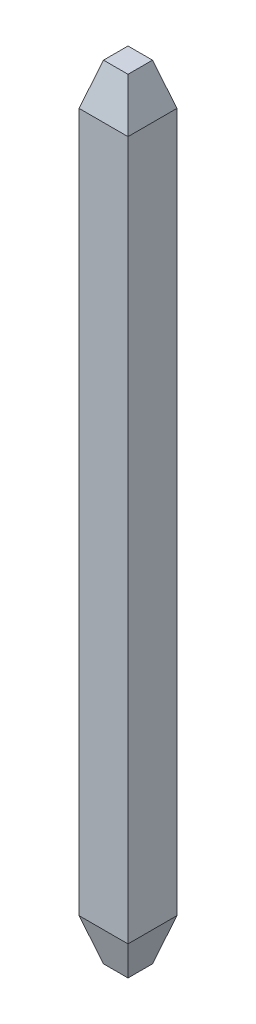
ISO-10303-21;
HEADER;
FILE_DESCRIPTION(('STEP AP214'),'2;1');
FILE_NAME('part.step','',(''),(''),'','','');
FILE_SCHEMA(('AUTOMOTIVE_DESIGN { 1 0 10303 214 1 1 1 1 }'));
ENDSEC;
DATA;
#1=APPLICATION_CONTEXT('core data for automotive mechanical design processes');
#2=APPLICATION_PROTOCOL_DEFINITION('international standard','automotive_design',2000,#1);
#3=PRODUCT_CONTEXT('',#1,'mechanical');
#4=PRODUCT('Part','Part','',(#3));
#5=PRODUCT_RELATED_PRODUCT_CATEGORY('part','',(#4));
#6=PRODUCT_DEFINITION_FORMATION('','',#4);
#7=PRODUCT_DEFINITION_CONTEXT('part definition',#1,'design');
#8=PRODUCT_DEFINITION('design','',#6,#7);
#9=PRODUCT_DEFINITION_SHAPE('','',#8);
#10=(LENGTH_UNIT() NAMED_UNIT(*) SI_UNIT(.MILLI.,.METRE.));
#11=(NAMED_UNIT(*) PLANE_ANGLE_UNIT() SI_UNIT($,.RADIAN.));
#12=(NAMED_UNIT(*) SI_UNIT($,.STERADIAN.) SOLID_ANGLE_UNIT());
#13=UNCERTAINTY_MEASURE_WITH_UNIT(LENGTH_MEASURE(1.E-05),#10,'distance_accuracy_value','');
#14=(GEOMETRIC_REPRESENTATION_CONTEXT(3) GLOBAL_UNCERTAINTY_ASSIGNED_CONTEXT((#13)) GLOBAL_UNIT_ASSIGNED_CONTEXT((#10,
#11,#12)) REPRESENTATION_CONTEXT('',''));
#15=CARTESIAN_POINT('',(0.,0.,0.));
#16=DIRECTION('',(0.,0.,1.));
#17=DIRECTION('',(1.,0.,0.));
#18=AXIS2_PLACEMENT_3D('',#15,#16,#17);
#19=CARTESIAN_POINT('',(4.29000000001296,-10.1039999999832,-19.5199999999763));
#20=DIRECTION('',(0.959644900900968,-0.281214622974643,0.));
#21=DIRECTION('',(0.,0.,-1.));
#22=AXIS2_PLACEMENT_3D('',#19,#20,#21);
#23=PLANE('',#22);
#24=DIRECTION('',(0.,0.,1.));
#25=VECTOR('',#24,1.);
#26=CARTESIAN_POINT('',(4.29000000001296,-10.1039999999832,-19.8399999999763));
#27=LINE('',#26,#25);
#28=CARTESIAN_POINT('',(4.29000000001293,-10.1039999999832,-19.8399999999763));
#29=VERTEX_POINT('',#28);
#30=CARTESIAN_POINT('',(4.29000000001293,-10.1039999999832,-19.1999999999763));
#31=VERTEX_POINT('',#30);
#32=EDGE_CURVE('E11',#29,#31,#27,.T.);
#33=ORIENTED_EDGE('',*,*,#32,.T.);
#34=DIRECTION('',(-0.270714017147727,-0.923811583516618,-0.270714017147727));
#35=VECTOR('',#34,1.);
#36=CARTESIAN_POINT('',(4.29000000001296,-10.1039999999832,-19.1999999999763));
#37=LINE('',#36,#35);
#38=CARTESIAN_POINT('',(4.13000000001293,-10.6499999999832,-19.3599999999763));
#39=VERTEX_POINT('',#38);
#40=EDGE_CURVE('E28',#31,#39,#37,.T.);
#41=ORIENTED_EDGE('',*,*,#40,.T.);
#42=DIRECTION('',(0.,0.,1.));
#43=VECTOR('',#42,1.);
#44=CARTESIAN_POINT('',(4.13000000001296,-10.6499999999832,-19.6799999999763));
#45=LINE('',#44,#43);
#46=CARTESIAN_POINT('',(4.13000000001293,-10.6499999999832,-19.6799999999763));
#47=VERTEX_POINT('',#46);
#48=EDGE_CURVE('E96',#47,#39,#45,.T.);
#49=ORIENTED_EDGE('',*,*,#48,.F.);
#50=DIRECTION('',(-0.270714017147727,-0.923811583516618,0.270714017147727));
#51=VECTOR('',#50,1.);
#52=CARTESIAN_POINT('',(4.29000000001296,-10.1039999999832,-19.8399999999763));
#53=LINE('',#52,#51);
#54=EDGE_CURVE('E21',#29,#47,#53,.T.);
#55=ORIENTED_EDGE('',*,*,#54,.F.);
#56=EDGE_LOOP('',(#33,#41,#49,#55));
#57=FACE_BOUND('',#56,.T.);
#58=ADVANCED_FACE('F17',(#57),#23,.T.);
#59=CARTESIAN_POINT('',(4.29000000001296,-11.0738701069127,-19.5199999999763));
#60=DIRECTION('',(1.,0.,0.));
#61=DIRECTION('',(0.,1.,0.));
#62=AXIS2_PLACEMENT_3D('',#59,#60,#61);
#63=PLANE('',#62);
#64=DIRECTION('',(0.,1.,0.));
#65=VECTOR('',#64,1.);
#66=CARTESIAN_POINT('',(4.29000000001296,-10.1039999999832,-19.1999999999763));
#67=LINE('',#66,#65);
#68=CARTESIAN_POINT('',(4.29000000001293,-0.965870106912663,-19.1999999999763));
#69=VERTEX_POINT('',#68);
#70=EDGE_CURVE('E42',#31,#69,#67,.T.);
#71=ORIENTED_EDGE('',*,*,#70,.F.);
#72=ORIENTED_EDGE('',*,*,#32,.F.);
#73=DIRECTION('',(0.,1.,0.));
#74=VECTOR('',#73,1.);
#75=CARTESIAN_POINT('',(4.29000000001296,-10.1039999999832,-19.8399999999763));
#76=LINE('',#75,#74);
#77=CARTESIAN_POINT('',(4.29000000001293,-0.965870106912663,-19.8399999999763));
#78=VERTEX_POINT('',#77);
#79=EDGE_CURVE('E140',#29,#78,#76,.T.);
#80=ORIENTED_EDGE('',*,*,#79,.T.);
#81=DIRECTION('',(0.,0.,1.));
#82=VECTOR('',#81,1.);
#83=CARTESIAN_POINT('',(4.29000000001296,-0.965870106912661,-19.8399999999763));
#84=LINE('',#83,#82);
#85=EDGE_CURVE('E194',#78,#69,#84,.T.);
#86=ORIENTED_EDGE('',*,*,#85,.T.);
#87=EDGE_LOOP('',(#71,#72,#80,#86));
#88=FACE_BOUND('',#87,.T.);
#89=ADVANCED_FACE('F245',(#88),#63,.T.);
#90=CARTESIAN_POINT('',(3.64900000001297,-5.53543505344793,-19.1999999999763));
#91=DIRECTION('',(0.,0.,1.));
#92=DIRECTION('',(1.,0.,0.));
#93=AXIS2_PLACEMENT_3D('',#90,#91,#92);
#94=PLANE('',#93);
#95=DIRECTION('',(0.,1.,0.));
#96=VECTOR('',#95,1.);
#97=CARTESIAN_POINT('',(3.65000000001294,-10.1039999999832,-19.1999999999763));
#98=LINE('',#97,#96);
#99=CARTESIAN_POINT('',(3.65000000001294,-10.1039999999832,-19.1999999999763));
#100=VERTEX_POINT('',#99);
#101=CARTESIAN_POINT('',(3.65000000001294,-0.965870106912663,-19.1999999999763));
#102=VERTEX_POINT('',#101);
#103=EDGE_CURVE('E150',#100,#102,#98,.T.);
#104=ORIENTED_EDGE('',*,*,#103,.F.);
#105=DIRECTION('',(-1.,0.,0.));
#106=VECTOR('',#105,1.);
#107=CARTESIAN_POINT('',(4.29000000001296,-10.1039999999832,-19.1999999999763));
#108=LINE('',#107,#106);
#109=EDGE_CURVE('E113',#31,#100,#108,.T.);
#110=ORIENTED_EDGE('',*,*,#109,.F.);
#111=ORIENTED_EDGE('',*,*,#70,.T.);
#112=DIRECTION('',(-1.,0.,0.));
#113=VECTOR('',#112,1.);
#114=CARTESIAN_POINT('',(4.29000000001296,-0.965870106912661,-19.1999999999763));
#115=LINE('',#114,#113);
#116=EDGE_CURVE('E154',#69,#102,#115,.T.);
#117=ORIENTED_EDGE('',*,*,#116,.T.);
#118=EDGE_LOOP('',(#104,#110,#111,#117));
#119=FACE_BOUND('',#118,.T.);
#120=ADVANCED_FACE('F228',(#119),#94,.T.);
#121=CARTESIAN_POINT('',(3.65000000001294,-5.53543505344793,-19.1989999999763));
#122=DIRECTION('',(-1.,0.,0.));
#123=DIRECTION('',(0.,0.,1.));
#124=AXIS2_PLACEMENT_3D('',#121,#122,#123);
#125=PLANE('',#124);
#126=DIRECTION('',(0.,1.,0.));
#127=VECTOR('',#126,1.);
#128=CARTESIAN_POINT('',(3.65000000001294,-10.1039999999832,-19.8399999999763));
#129=LINE('',#128,#127);
#130=CARTESIAN_POINT('',(3.65000000001294,-10.1039999999832,-19.8399999999763));
#131=VERTEX_POINT('',#130);
#132=CARTESIAN_POINT('',(3.65000000001294,-0.965870106912663,-19.8399999999763));
#133=VERTEX_POINT('',#132);
#134=EDGE_CURVE('E159',#131,#133,#129,.T.);
#135=ORIENTED_EDGE('',*,*,#134,.F.);
#136=DIRECTION('',(0.,0.,-1.));
#137=VECTOR('',#136,1.);
#138=CARTESIAN_POINT('',(3.65000000001294,-10.1039999999832,-19.1999999999763));
#139=LINE('',#138,#137);
#140=EDGE_CURVE('E167',#100,#131,#139,.T.);
#141=ORIENTED_EDGE('',*,*,#140,.F.);
#142=ORIENTED_EDGE('',*,*,#103,.T.);
#143=DIRECTION('',(0.,0.,-1.));
#144=VECTOR('',#143,1.);
#145=CARTESIAN_POINT('',(3.65000000001294,-0.965870106912661,-19.1999999999763));
#146=LINE('',#145,#144);
#147=EDGE_CURVE('E155',#102,#133,#146,.T.);
#148=ORIENTED_EDGE('',*,*,#147,.T.);
#149=EDGE_LOOP('',(#135,#141,#142,#148));
#150=FACE_BOUND('',#149,.T.);
#151=ADVANCED_FACE('F259',(#150),#125,.T.);
#152=CARTESIAN_POINT('',(3.65000000001294,-0.965870106912661,-19.5199999999763));
#153=DIRECTION('',(-0.959644900900968,0.281214622974643,0.));
#154=DIRECTION('',(0.,0.,1.));
#155=AXIS2_PLACEMENT_3D('',#152,#153,#154);
#156=PLANE('',#155);
#157=DIRECTION('',(0.270714017147727,0.923811583516618,-0.270714017147727));
#158=VECTOR('',#157,1.);
#159=CARTESIAN_POINT('',(3.65000000001294,-0.965870106912661,-19.1999999999763));
#160=LINE('',#159,#158);
#161=CARTESIAN_POINT('',(3.81000000001294,-0.419870106912663,-19.3599999999763));
#162=VERTEX_POINT('',#161);
#163=EDGE_CURVE('E146',#102,#162,#160,.T.);
#164=ORIENTED_EDGE('',*,*,#163,.T.);
#165=DIRECTION('',(0.,0.,-1.));
#166=VECTOR('',#165,1.);
#167=CARTESIAN_POINT('',(3.81000000001294,-0.419870106912661,-19.3599999999763));
#168=LINE('',#167,#166);
#169=CARTESIAN_POINT('',(3.81000000001294,-0.419870106912663,-19.6799999999763));
#170=VERTEX_POINT('',#169);
#171=EDGE_CURVE('E142',#162,#170,#168,.T.);
#172=ORIENTED_EDGE('',*,*,#171,.T.);
#173=DIRECTION('',(0.270714017147727,0.923811583516618,0.270714017147727));
#174=VECTOR('',#173,1.);
#175=CARTESIAN_POINT('',(3.65000000001294,-0.965870106912661,-19.8399999999763));
#176=LINE('',#175,#174);
#177=EDGE_CURVE('E147',#133,#170,#176,.T.);
#178=ORIENTED_EDGE('',*,*,#177,.F.);
#179=ORIENTED_EDGE('',*,*,#147,.F.);
#180=EDGE_LOOP('',(#164,#172,#178,#179));
#181=FACE_BOUND('',#180,.T.);
#182=ADVANCED_FACE('F256',(#181),#156,.T.);
#183=CARTESIAN_POINT('',(3.97000000001295,-0.965870106912661,-19.8399999999763));
#184=DIRECTION('',(0.,0.281214622974643,-0.959644900900968));
#185=DIRECTION('',(-1.,0.,0.));
#186=AXIS2_PLACEMENT_3D('',#183,#184,#185);
#187=PLANE('',#186);
#188=ORIENTED_EDGE('',*,*,#177,.T.);
#189=DIRECTION('',(1.,0.,0.));
#190=VECTOR('',#189,1.);
#191=CARTESIAN_POINT('',(3.81000000001294,-0.419870106912661,-19.6799999999763));
#192=LINE('',#191,#190);
#193=CARTESIAN_POINT('',(4.13000000001293,-0.419870106912663,-19.6799999999763));
#194=VERTEX_POINT('',#193);
#195=EDGE_CURVE('E172',#170,#194,#192,.T.);
#196=ORIENTED_EDGE('',*,*,#195,.T.);
#197=DIRECTION('',(-0.270714017147727,0.923811583516618,0.270714017147727));
#198=VECTOR('',#197,1.);
#199=CARTESIAN_POINT('',(4.29000000001296,-0.965870106912661,-19.8399999999763));
#200=LINE('',#199,#198);
#201=EDGE_CURVE('E158',#78,#194,#200,.T.);
#202=ORIENTED_EDGE('',*,*,#201,.F.);
#203=DIRECTION('',(1.,0.,0.));
#204=VECTOR('',#203,1.);
#205=CARTESIAN_POINT('',(3.65000000001294,-0.965870106912661,-19.8399999999763));
#206=LINE('',#205,#204);
#207=EDGE_CURVE('E165',#133,#78,#206,.T.);
#208=ORIENTED_EDGE('',*,*,#207,.F.);
#209=EDGE_LOOP('',(#188,#196,#202,#208));
#210=FACE_BOUND('',#209,.T.);
#211=ADVANCED_FACE('F253',(#210),#187,.T.);
#212=CARTESIAN_POINT('',(3.97000000001295,-0.419870106912661,-19.6809999999763));
#213=DIRECTION('',(0.,1.,0.));
#214=DIRECTION('',(1.,0.,0.));
#215=AXIS2_PLACEMENT_3D('',#212,#213,#214);
#216=PLANE('',#215);
#217=ORIENTED_EDGE('',*,*,#195,.F.);
#218=ORIENTED_EDGE('',*,*,#171,.F.);
#219=DIRECTION('',(-1.,0.,0.));
#220=VECTOR('',#219,1.);
#221=CARTESIAN_POINT('',(4.13000000001296,-0.419870106912661,-19.3599999999763));
#222=LINE('',#221,#220);
#223=CARTESIAN_POINT('',(4.13000000001293,-0.419870106912663,-19.3599999999763));
#224=VERTEX_POINT('',#223);
#225=EDGE_CURVE('E204',#224,#162,#222,.T.);
#226=ORIENTED_EDGE('',*,*,#225,.F.);
#227=DIRECTION('',(0.,0.,1.));
#228=VECTOR('',#227,1.);
#229=CARTESIAN_POINT('',(4.13000000001296,-0.419870106912661,-19.6799999999763));
#230=LINE('',#229,#228);
#231=EDGE_CURVE('E156',#194,#224,#230,.T.);
#232=ORIENTED_EDGE('',*,*,#231,.F.);
#233=EDGE_LOOP('',(#217,#218,#226,#232));
#234=FACE_BOUND('',#233,.T.);
#235=ADVANCED_FACE('F240',(#234),#216,.T.);
#236=CARTESIAN_POINT('',(3.65000000001294,-10.1039999999832,-19.5199999999763));
#237=DIRECTION('',(-0.959644900900968,-0.281214622974643,0.));
#238=DIRECTION('',(-0.281214622974643,0.959644900900968,0.));
#239=AXIS2_PLACEMENT_3D('',#236,#237,#238);
#240=PLANE('',#239);
#241=ORIENTED_EDGE('',*,*,#140,.T.);
#242=DIRECTION('',(0.270714017147727,-0.923811583516618,0.270714017147727));
#243=VECTOR('',#242,1.);
#244=CARTESIAN_POINT('',(3.65000000001294,-10.1039999999832,-19.8399999999763));
#245=LINE('',#244,#243);
#246=CARTESIAN_POINT('',(3.81000000001294,-10.6499999999832,-19.6799999999763));
#247=VERTEX_POINT('',#246);
#248=EDGE_CURVE('E123',#131,#247,#245,.T.);
#249=ORIENTED_EDGE('',*,*,#248,.T.);
#250=DIRECTION('',(0.,0.,-1.));
#251=VECTOR('',#250,1.);
#252=CARTESIAN_POINT('',(3.81000000001294,-10.6499999999832,-19.3599999999763));
#253=LINE('',#252,#251);
#254=CARTESIAN_POINT('',(3.81000000001294,-10.6499999999832,-19.3599999999763));
#255=VERTEX_POINT('',#254);
#256=EDGE_CURVE('E120',#255,#247,#253,.T.);
#257=ORIENTED_EDGE('',*,*,#256,.F.);
#258=DIRECTION('',(0.270714017147727,-0.923811583516618,-0.270714017147727));
#259=VECTOR('',#258,1.);
#260=CARTESIAN_POINT('',(3.65000000001294,-10.1039999999832,-19.1999999999763));
#261=LINE('',#260,#259);
#262=EDGE_CURVE('E107',#100,#255,#261,.T.);
#263=ORIENTED_EDGE('',*,*,#262,.F.);
#264=EDGE_LOOP('',(#241,#249,#257,#263));
#265=FACE_BOUND('',#264,.T.);
#266=ADVANCED_FACE('F121',(#265),#240,.T.);
#267=CARTESIAN_POINT('',(3.97000000001295,-0.965870106912661,-19.1999999999763));
#268=DIRECTION('',(0.,0.281214622974643,0.959644900900968));
#269=DIRECTION('',(1.,0.,0.));
#270=AXIS2_PLACEMENT_3D('',#267,#268,#269);
#271=PLANE('',#270);
#272=DIRECTION('',(-0.270714017147727,0.923811583516618,-0.270714017147727));
#273=VECTOR('',#272,1.);
#274=CARTESIAN_POINT('',(4.29000000001296,-0.965870106912661,-19.1999999999763));
#275=LINE('',#274,#273);
#276=EDGE_CURVE('E168',#69,#224,#275,.T.);
#277=ORIENTED_EDGE('',*,*,#276,.T.);
#278=ORIENTED_EDGE('',*,*,#225,.T.);
#279=ORIENTED_EDGE('',*,*,#163,.F.);
#280=ORIENTED_EDGE('',*,*,#116,.F.);
#281=EDGE_LOOP('',(#277,#278,#279,#280));
#282=FACE_BOUND('',#281,.T.);
#283=ADVANCED_FACE('F229',(#282),#271,.T.);
#284=CARTESIAN_POINT('',(4.29000000001296,-0.965870106912661,-19.5199999999763));
#285=DIRECTION('',(0.959644900900968,0.281214622974643,0.));
#286=DIRECTION('',(0.,0.,-1.));
#287=AXIS2_PLACEMENT_3D('',#284,#285,#286);
#288=PLANE('',#287);
#289=ORIENTED_EDGE('',*,*,#201,.T.);
#290=ORIENTED_EDGE('',*,*,#231,.T.);
#291=ORIENTED_EDGE('',*,*,#276,.F.);
#292=ORIENTED_EDGE('',*,*,#85,.F.);
#293=EDGE_LOOP('',(#289,#290,#291,#292));
#294=FACE_BOUND('',#293,.T.);
#295=ADVANCED_FACE('F19',(#294),#288,.T.);
#296=CARTESIAN_POINT('',(4.29100000001296,-5.53443505344793,-19.8399999999763));
#297=DIRECTION('',(0.,0.,-1.));
#298=DIRECTION('',(0.,-1.,0.));
#299=AXIS2_PLACEMENT_3D('',#296,#297,#298);
#300=PLANE('',#299);
#301=ORIENTED_EDGE('',*,*,#79,.F.);
#302=DIRECTION('',(1.,0.,0.));
#303=VECTOR('',#302,1.);
#304=CARTESIAN_POINT('',(3.65000000001294,-10.1039999999832,-19.8399999999763));
#305=LINE('',#304,#303);
#306=EDGE_CURVE('E161',#131,#29,#305,.T.);
#307=ORIENTED_EDGE('',*,*,#306,.F.);
#308=ORIENTED_EDGE('',*,*,#134,.T.);
#309=ORIENTED_EDGE('',*,*,#207,.T.);
#310=EDGE_LOOP('',(#301,#307,#308,#309));
#311=FACE_BOUND('',#310,.T.);
#312=ADVANCED_FACE('F239',(#311),#300,.T.);
#313=CARTESIAN_POINT('',(3.97000000001295,-10.1039999999832,-19.8399999999763));
#314=DIRECTION('',(0.,-0.281214622974643,-0.959644900900968));
#315=DIRECTION('',(0.,-0.959644900900968,0.281214622974643));
#316=AXIS2_PLACEMENT_3D('',#313,#314,#315);
#317=PLANE('',#316);
#318=ORIENTED_EDGE('',*,*,#306,.T.);
#319=ORIENTED_EDGE('',*,*,#54,.T.);
#320=DIRECTION('',(1.,0.,0.));
#321=VECTOR('',#320,1.);
#322=CARTESIAN_POINT('',(3.81000000001294,-10.6499999999832,-19.6799999999763));
#323=LINE('',#322,#321);
#324=EDGE_CURVE('E128',#247,#47,#323,.T.);
#325=ORIENTED_EDGE('',*,*,#324,.F.);
#326=ORIENTED_EDGE('',*,*,#248,.F.);
#327=EDGE_LOOP('',(#318,#319,#325,#326));
#328=FACE_BOUND('',#327,.T.);
#329=ADVANCED_FACE('F261',(#328),#317,.T.);
#330=CARTESIAN_POINT('',(3.80900000001296,-10.6499999999832,-19.5199999999763));
#331=DIRECTION('',(0.,-1.,0.));
#332=DIRECTION('',(0.,0.,-1.));
#333=AXIS2_PLACEMENT_3D('',#330,#331,#332);
#334=PLANE('',#333);
#335=ORIENTED_EDGE('',*,*,#48,.T.);
#336=DIRECTION('',(-1.,0.,0.));
#337=VECTOR('',#336,1.);
#338=CARTESIAN_POINT('',(4.13000000001296,-10.6499999999832,-19.3599999999763));
#339=LINE('',#338,#337);
#340=EDGE_CURVE('E111',#39,#255,#339,.T.);
#341=ORIENTED_EDGE('',*,*,#340,.T.);
#342=ORIENTED_EDGE('',*,*,#256,.T.);
#343=ORIENTED_EDGE('',*,*,#324,.T.);
#344=EDGE_LOOP('',(#335,#341,#342,#343));
#345=FACE_BOUND('',#344,.T.);
#346=ADVANCED_FACE('F130',(#345),#334,.T.);
#347=CARTESIAN_POINT('',(3.97000000001295,-10.1039999999832,-19.1999999999763));
#348=DIRECTION('',(0.,-0.281214622974643,0.959644900900968));
#349=DIRECTION('',(-1.,0.,0.));
#350=AXIS2_PLACEMENT_3D('',#347,#348,#349);
#351=PLANE('',#350);
#352=ORIENTED_EDGE('',*,*,#109,.T.);
#353=ORIENTED_EDGE('',*,*,#262,.T.);
#354=ORIENTED_EDGE('',*,*,#340,.F.);
#355=ORIENTED_EDGE('',*,*,#40,.F.);
#356=EDGE_LOOP('',(#352,#353,#354,#355));
#357=FACE_BOUND('',#356,.T.);
#358=ADVANCED_FACE('F109',(#357),#351,.T.);
#359=CLOSED_SHELL('',(#58,#89,#120,#151,#182,#211,#235,#266,#283,#295,#312,#329,#346,#358));
#360=MANIFOLD_SOLID_BREP('B1',#359);
#361=ADVANCED_BREP_SHAPE_REPRESENTATION('',(#18,#360),#14);
#362=SHAPE_DEFINITION_REPRESENTATION(#9,#361);
ENDSEC;
END-ISO-10303-21;
